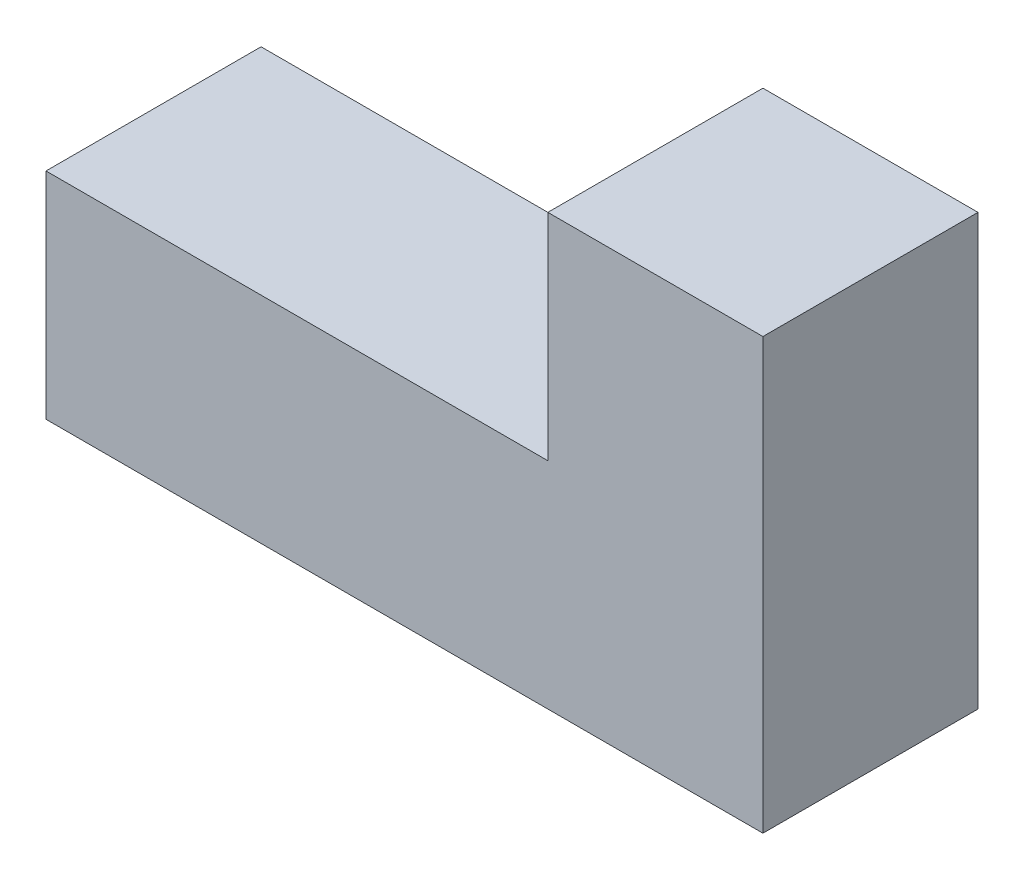
ISO-10303-21;
HEADER;
FILE_DESCRIPTION(('STEP AP214'),'2;1');
FILE_NAME('part.step','',(''),(''),'','','');
FILE_SCHEMA(('AUTOMOTIVE_DESIGN { 1 0 10303 214 1 1 1 1 }'));
ENDSEC;
DATA;
#1=APPLICATION_CONTEXT('core data for automotive mechanical design processes');
#2=APPLICATION_PROTOCOL_DEFINITION('international standard','automotive_design',2000,#1);
#3=PRODUCT_CONTEXT('',#1,'mechanical');
#4=PRODUCT('Part','Part','',(#3));
#5=PRODUCT_RELATED_PRODUCT_CATEGORY('part','',(#4));
#6=PRODUCT_DEFINITION_FORMATION('','',#4);
#7=PRODUCT_DEFINITION_CONTEXT('part definition',#1,'design');
#8=PRODUCT_DEFINITION('design','',#6,#7);
#9=PRODUCT_DEFINITION_SHAPE('','',#8);
#10=(LENGTH_UNIT() NAMED_UNIT(*) SI_UNIT(.MILLI.,.METRE.));
#11=(NAMED_UNIT(*) PLANE_ANGLE_UNIT() SI_UNIT($,.RADIAN.));
#12=(NAMED_UNIT(*) SI_UNIT($,.STERADIAN.) SOLID_ANGLE_UNIT());
#13=UNCERTAINTY_MEASURE_WITH_UNIT(LENGTH_MEASURE(1.E-05),#10,'distance_accuracy_value','');
#14=(GEOMETRIC_REPRESENTATION_CONTEXT(3) GLOBAL_UNCERTAINTY_ASSIGNED_CONTEXT((#13)) GLOBAL_UNIT_ASSIGNED_CONTEXT((#10,
#11,#12)) REPRESENTATION_CONTEXT('',''));
#15=CARTESIAN_POINT('',(0.,0.,0.));
#16=DIRECTION('',(0.,0.,1.));
#17=DIRECTION('',(1.,0.,0.));
#18=AXIS2_PLACEMENT_3D('',#15,#16,#17);
#19=CARTESIAN_POINT('',(0.,0.,30.));
#20=DIRECTION('',(1.,0.,0.));
#21=DIRECTION('',(0.,0.,-1.));
#22=AXIS2_PLACEMENT_3D('',#19,#20,#21);
#23=PLANE('',#22);
#24=DIRECTION('',(0.,-1.,0.));
#25=VECTOR('',#24,1.);
#26=CARTESIAN_POINT('',(0.,0.,0.));
#27=LINE('',#26,#25);
#28=CARTESIAN_POINT('',(0.,30.,0.));
#29=VERTEX_POINT('',#28);
#30=CARTESIAN_POINT('',(0.,0.,0.));
#31=VERTEX_POINT('',#30);
#32=EDGE_CURVE('E128',#29,#31,#27,.T.);
#33=ORIENTED_EDGE('',*,*,#32,.T.);
#34=DIRECTION('',(0.,0.,-1.));
#35=VECTOR('',#34,1.);
#36=CARTESIAN_POINT('',(0.,0.,30.));
#37=LINE('',#36,#35);
#38=CARTESIAN_POINT('',(0.,0.,30.));
#39=VERTEX_POINT('',#38);
#40=EDGE_CURVE('E11',#39,#31,#37,.T.);
#41=ORIENTED_EDGE('',*,*,#40,.F.);
#42=DIRECTION('',(0.,-1.,0.));
#43=VECTOR('',#42,1.);
#44=CARTESIAN_POINT('',(0.,0.,30.));
#45=LINE('',#44,#43);
#46=CARTESIAN_POINT('',(0.,30.,30.));
#47=VERTEX_POINT('',#46);
#48=EDGE_CURVE('E144',#47,#39,#45,.T.);
#49=ORIENTED_EDGE('',*,*,#48,.F.);
#50=DIRECTION('',(0.,0.,-1.));
#51=VECTOR('',#50,1.);
#52=CARTESIAN_POINT('',(0.,30.,30.));
#53=LINE('',#52,#51);
#54=EDGE_CURVE('E124',#47,#29,#53,.T.);
#55=ORIENTED_EDGE('',*,*,#54,.T.);
#56=EDGE_LOOP('',(#33,#41,#49,#55));
#57=FACE_BOUND('',#56,.T.);
#58=ADVANCED_FACE('F39',(#57),#23,.F.);
#59=CARTESIAN_POINT('',(0.,0.,30.));
#60=DIRECTION('',(0.,1.,0.));
#61=DIRECTION('',(0.,0.,1.));
#62=AXIS2_PLACEMENT_3D('',#59,#60,#61);
#63=PLANE('',#62);
#64=DIRECTION('',(1.,0.,0.));
#65=VECTOR('',#64,1.);
#66=CARTESIAN_POINT('',(0.,0.,0.));
#67=LINE('',#66,#65);
#68=CARTESIAN_POINT('',(100.,0.,0.));
#69=VERTEX_POINT('',#68);
#70=EDGE_CURVE('E132',#31,#69,#67,.T.);
#71=ORIENTED_EDGE('',*,*,#70,.T.);
#72=DIRECTION('',(0.,0.,-1.));
#73=VECTOR('',#72,1.);
#74=CARTESIAN_POINT('',(100.,0.,30.));
#75=LINE('',#74,#73);
#76=CARTESIAN_POINT('',(100.,0.,30.));
#77=VERTEX_POINT('',#76);
#78=EDGE_CURVE('E48',#77,#69,#75,.T.);
#79=ORIENTED_EDGE('',*,*,#78,.F.);
#80=DIRECTION('',(1.,0.,0.));
#81=VECTOR('',#80,1.);
#82=CARTESIAN_POINT('',(0.,0.,30.));
#83=LINE('',#82,#81);
#84=EDGE_CURVE('E93',#39,#77,#83,.T.);
#85=ORIENTED_EDGE('',*,*,#84,.F.);
#86=ORIENTED_EDGE('',*,*,#40,.T.);
#87=EDGE_LOOP('',(#71,#79,#85,#86));
#88=FACE_BOUND('',#87,.T.);
#89=ADVANCED_FACE('F172',(#88),#63,.F.);
#90=CARTESIAN_POINT('',(100.,0.,30.));
#91=DIRECTION('',(-1.,0.,0.));
#92=DIRECTION('',(0.,0.,1.));
#93=AXIS2_PLACEMENT_3D('',#90,#91,#92);
#94=PLANE('',#93);
#95=DIRECTION('',(0.,1.,0.));
#96=VECTOR('',#95,1.);
#97=CARTESIAN_POINT('',(100.,0.,0.));
#98=LINE('',#97,#96);
#99=CARTESIAN_POINT('',(100.,60.,0.));
#100=VERTEX_POINT('',#99);
#101=EDGE_CURVE('E135',#69,#100,#98,.T.);
#102=ORIENTED_EDGE('',*,*,#101,.T.);
#103=DIRECTION('',(0.,0.,-1.));
#104=VECTOR('',#103,1.);
#105=CARTESIAN_POINT('',(100.,60.,30.));
#106=LINE('',#105,#104);
#107=CARTESIAN_POINT('',(100.,60.,30.));
#108=VERTEX_POINT('',#107);
#109=EDGE_CURVE('E117',#108,#100,#106,.T.);
#110=ORIENTED_EDGE('',*,*,#109,.F.);
#111=DIRECTION('',(0.,1.,0.));
#112=VECTOR('',#111,1.);
#113=CARTESIAN_POINT('',(100.,0.,30.));
#114=LINE('',#113,#112);
#115=EDGE_CURVE('E106',#77,#108,#114,.T.);
#116=ORIENTED_EDGE('',*,*,#115,.F.);
#117=ORIENTED_EDGE('',*,*,#78,.T.);
#118=EDGE_LOOP('',(#102,#110,#116,#117));
#119=FACE_BOUND('',#118,.T.);
#120=ADVANCED_FACE('F154',(#119),#94,.F.);
#121=CARTESIAN_POINT('',(70.,60.,30.));
#122=DIRECTION('',(0.,-1.,0.));
#123=DIRECTION('',(0.,0.,-1.));
#124=AXIS2_PLACEMENT_3D('',#121,#122,#123);
#125=PLANE('',#124);
#126=DIRECTION('',(-1.,0.,0.));
#127=VECTOR('',#126,1.);
#128=CARTESIAN_POINT('',(70.,60.,0.));
#129=LINE('',#128,#127);
#130=CARTESIAN_POINT('',(70.,60.,0.));
#131=VERTEX_POINT('',#130);
#132=EDGE_CURVE('E115',#100,#131,#129,.T.);
#133=ORIENTED_EDGE('',*,*,#132,.T.);
#134=DIRECTION('',(0.,0.,-1.));
#135=VECTOR('',#134,1.);
#136=CARTESIAN_POINT('',(70.,60.,30.));
#137=LINE('',#136,#135);
#138=CARTESIAN_POINT('',(70.,60.,30.));
#139=VERTEX_POINT('',#138);
#140=EDGE_CURVE('E112',#139,#131,#137,.T.);
#141=ORIENTED_EDGE('',*,*,#140,.F.);
#142=DIRECTION('',(-1.,0.,0.));
#143=VECTOR('',#142,1.);
#144=CARTESIAN_POINT('',(70.,60.,30.));
#145=LINE('',#144,#143);
#146=EDGE_CURVE('E100',#108,#139,#145,.T.);
#147=ORIENTED_EDGE('',*,*,#146,.F.);
#148=ORIENTED_EDGE('',*,*,#109,.T.);
#149=EDGE_LOOP('',(#133,#141,#147,#148));
#150=FACE_BOUND('',#149,.T.);
#151=ADVANCED_FACE('F113',(#150),#125,.F.);
#152=CARTESIAN_POINT('',(70.,30.,30.));
#153=DIRECTION('',(1.,0.,0.));
#154=DIRECTION('',(0.,0.,-1.));
#155=AXIS2_PLACEMENT_3D('',#152,#153,#154);
#156=PLANE('',#155);
#157=DIRECTION('',(0.,-1.,0.));
#158=VECTOR('',#157,1.);
#159=CARTESIAN_POINT('',(70.,30.,0.));
#160=LINE('',#159,#158);
#161=CARTESIAN_POINT('',(70.,30.,0.));
#162=VERTEX_POINT('',#161);
#163=EDGE_CURVE('E79',#131,#162,#160,.T.);
#164=ORIENTED_EDGE('',*,*,#163,.T.);
#165=DIRECTION('',(0.,0.,-1.));
#166=VECTOR('',#165,1.);
#167=CARTESIAN_POINT('',(70.,30.,30.));
#168=LINE('',#167,#166);
#169=CARTESIAN_POINT('',(70.,30.,30.));
#170=VERTEX_POINT('',#169);
#171=EDGE_CURVE('E118',#170,#162,#168,.T.);
#172=ORIENTED_EDGE('',*,*,#171,.F.);
#173=DIRECTION('',(0.,-1.,0.));
#174=VECTOR('',#173,1.);
#175=CARTESIAN_POINT('',(70.,30.,30.));
#176=LINE('',#175,#174);
#177=EDGE_CURVE('E104',#139,#170,#176,.T.);
#178=ORIENTED_EDGE('',*,*,#177,.F.);
#179=ORIENTED_EDGE('',*,*,#140,.T.);
#180=EDGE_LOOP('',(#164,#172,#178,#179));
#181=FACE_BOUND('',#180,.T.);
#182=ADVANCED_FACE('F120',(#181),#156,.F.);
#183=CARTESIAN_POINT('',(0.,30.,30.));
#184=DIRECTION('',(0.,-1.,0.));
#185=DIRECTION('',(0.,0.,-1.));
#186=AXIS2_PLACEMENT_3D('',#183,#184,#185);
#187=PLANE('',#186);
#188=DIRECTION('',(-1.,0.,0.));
#189=VECTOR('',#188,1.);
#190=CARTESIAN_POINT('',(0.,30.,0.));
#191=LINE('',#190,#189);
#192=EDGE_CURVE('E85',#162,#29,#191,.T.);
#193=ORIENTED_EDGE('',*,*,#192,.T.);
#194=ORIENTED_EDGE('',*,*,#54,.F.);
#195=DIRECTION('',(-1.,0.,0.));
#196=VECTOR('',#195,1.);
#197=CARTESIAN_POINT('',(0.,30.,30.));
#198=LINE('',#197,#196);
#199=EDGE_CURVE('E56',#170,#47,#198,.T.);
#200=ORIENTED_EDGE('',*,*,#199,.F.);
#201=ORIENTED_EDGE('',*,*,#171,.T.);
#202=EDGE_LOOP('',(#193,#194,#200,#201));
#203=FACE_BOUND('',#202,.T.);
#204=ADVANCED_FACE('F161',(#203),#187,.F.);
#205=CARTESIAN_POINT('',(0.,0.,30.));
#206=DIRECTION('',(0.,0.,-1.));
#207=DIRECTION('',(-1.,0.,0.));
#208=AXIS2_PLACEMENT_3D('',#205,#206,#207);
#209=PLANE('',#208);
#210=ORIENTED_EDGE('',*,*,#48,.T.);
#211=ORIENTED_EDGE('',*,*,#84,.T.);
#212=ORIENTED_EDGE('',*,*,#115,.T.);
#213=ORIENTED_EDGE('',*,*,#146,.T.);
#214=ORIENTED_EDGE('',*,*,#177,.T.);
#215=ORIENTED_EDGE('',*,*,#199,.T.);
#216=EDGE_LOOP('',(#210,#211,#212,#213,#214,#215));
#217=FACE_BOUND('',#216,.T.);
#218=ADVANCED_FACE('F102',(#217),#209,.F.);
#219=CARTESIAN_POINT('',(0.,0.,0.));
#220=DIRECTION('',(0.,0.,-1.));
#221=DIRECTION('',(-1.,0.,0.));
#222=AXIS2_PLACEMENT_3D('',#219,#220,#221);
#223=PLANE('',#222);
#224=ORIENTED_EDGE('',*,*,#32,.F.);
#225=ORIENTED_EDGE('',*,*,#192,.F.);
#226=ORIENTED_EDGE('',*,*,#163,.F.);
#227=ORIENTED_EDGE('',*,*,#132,.F.);
#228=ORIENTED_EDGE('',*,*,#101,.F.);
#229=ORIENTED_EDGE('',*,*,#70,.F.);
#230=EDGE_LOOP('',(#224,#225,#226,#227,#228,#229));
#231=FACE_BOUND('',#230,.T.);
#232=ADVANCED_FACE('F157',(#231),#223,.T.);
#233=CLOSED_SHELL('',(#58,#89,#120,#151,#182,#204,#218,#232));
#234=MANIFOLD_SOLID_BREP('B2',#233);
#235=ADVANCED_BREP_SHAPE_REPRESENTATION('',(#18,#234),#14);
#236=SHAPE_DEFINITION_REPRESENTATION(#9,#235);
ENDSEC;
END-ISO-10303-21;
